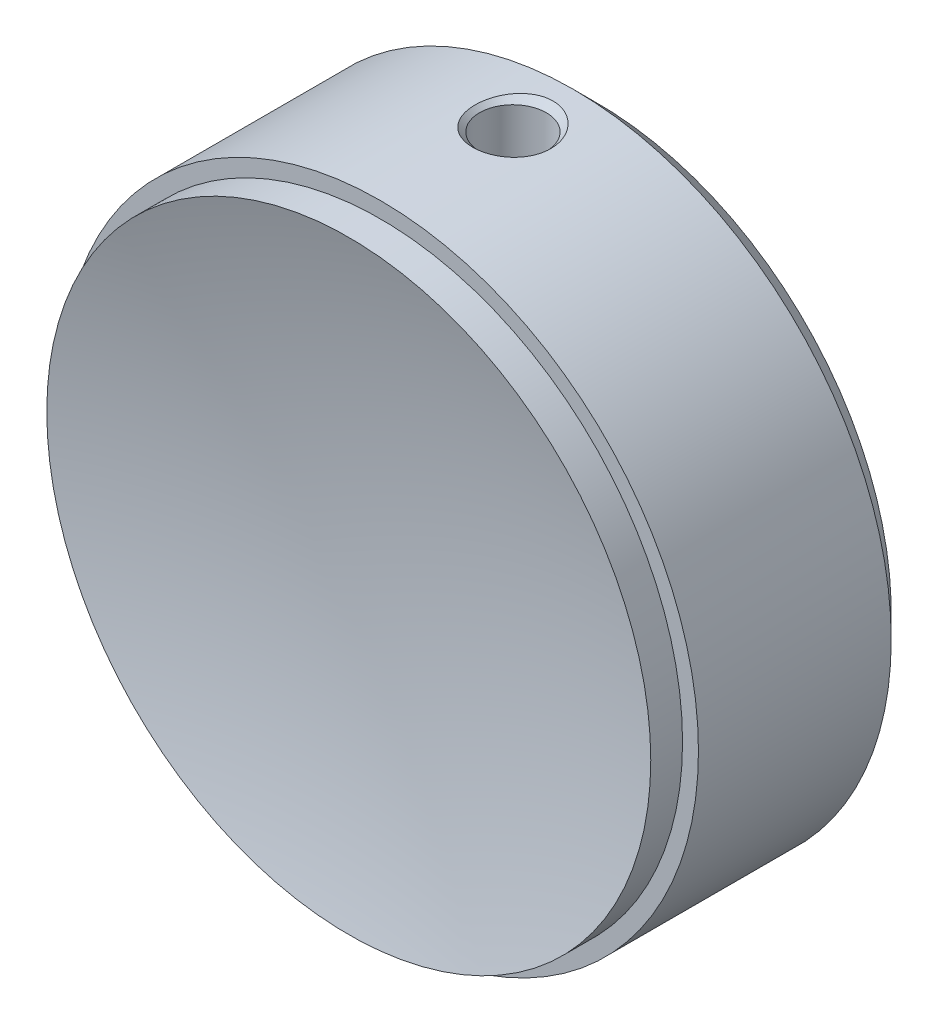
ISO-10303-21;
HEADER;
FILE_DESCRIPTION(('STEP AP214'),'2;1');
FILE_NAME('part.step','',(''),(''),'','','');
FILE_SCHEMA(('AUTOMOTIVE_DESIGN { 1 0 10303 214 1 1 1 1 }'));
ENDSEC;
DATA;
#1=APPLICATION_CONTEXT('core data for automotive mechanical design processes');
#2=APPLICATION_PROTOCOL_DEFINITION('international standard','automotive_design',2000,#1);
#3=PRODUCT_CONTEXT('',#1,'mechanical');
#4=PRODUCT('Part','Part','',(#3));
#5=PRODUCT_RELATED_PRODUCT_CATEGORY('part','',(#4));
#6=PRODUCT_DEFINITION_FORMATION('','',#4);
#7=PRODUCT_DEFINITION_CONTEXT('part definition',#1,'design');
#8=PRODUCT_DEFINITION('design','',#6,#7);
#9=PRODUCT_DEFINITION_SHAPE('','',#8);
#10=(LENGTH_UNIT() NAMED_UNIT(*) SI_UNIT(.MILLI.,.METRE.));
#11=(NAMED_UNIT(*) PLANE_ANGLE_UNIT() SI_UNIT($,.RADIAN.));
#12=(NAMED_UNIT(*) SI_UNIT($,.STERADIAN.) SOLID_ANGLE_UNIT());
#13=UNCERTAINTY_MEASURE_WITH_UNIT(LENGTH_MEASURE(1.E-05),#10,'distance_accuracy_value','');
#14=(GEOMETRIC_REPRESENTATION_CONTEXT(3) GLOBAL_UNCERTAINTY_ASSIGNED_CONTEXT((#13)) GLOBAL_UNIT_ASSIGNED_CONTEXT((#10,
#11,#12)) REPRESENTATION_CONTEXT('',''));
#15=CARTESIAN_POINT('',(0.,0.,0.));
#16=DIRECTION('',(0.,0.,1.));
#17=DIRECTION('',(1.,0.,0.));
#18=AXIS2_PLACEMENT_3D('',#15,#16,#17);
#19=CARTESIAN_POINT('',(0.,0.,83.));
#20=DIRECTION('',(0.,0.,-1.));
#21=DIRECTION('',(-1.,0.,0.));
#22=AXIS2_PLACEMENT_3D('',#19,#20,#21);
#23=SPHERICAL_SURFACE('',#22,70.);
#24=CARTESIAN_POINT('',(0.,0.,15.6278989491941));
#25=DIRECTION('',(0.,0.,-1.));
#26=DIRECTION('',(-1.,0.,0.));
#27=AXIS2_PLACEMENT_3D('',#24,#25,#26);
#28=CIRCLE('',#27,19.);
#29=CARTESIAN_POINT('',(-19.,0.,15.6278989491941));
#30=VERTEX_POINT('',#29);
#31=EDGE_CURVE('E97',#30,#30,#28,.T.);
#32=ORIENTED_EDGE('',*,*,#31,.F.);
#33=EDGE_LOOP('',(#32));
#34=FACE_BOUND('',#33,.T.);
#35=ADVANCED_FACE('F40',(#34),#23,.F.);
#36=CARTESIAN_POINT('',(0.,0.,0.));
#37=DIRECTION('',(0.,0.,-1.));
#38=DIRECTION('',(-1.,0.,0.));
#39=AXIS2_PLACEMENT_3D('',#36,#37,#38);
#40=SPHERICAL_SURFACE('',#39,6.5);
#41=CARTESIAN_POINT('',(0.,0.,0.));
#42=DIRECTION('',(0.,0.,-1.));
#43=DIRECTION('',(-1.,0.,0.));
#44=AXIS2_PLACEMENT_3D('',#41,#42,#43);
#45=CIRCLE('',#44,6.5);
#46=CARTESIAN_POINT('',(-6.5,0.,0.));
#47=VERTEX_POINT('',#46);
#48=EDGE_CURVE('E51',#47,#47,#45,.T.);
#49=ORIENTED_EDGE('',*,*,#48,.T.);
#50=EDGE_LOOP('',(#49));
#51=FACE_BOUND('',#50,.T.);
#52=ADVANCED_FACE('F114',(#51),#40,.F.);
#53=CARTESIAN_POINT('',(0.,0.,0.));
#54=DIRECTION('',(0.,0.,-1.));
#55=DIRECTION('',(-1.,0.,0.));
#56=AXIS2_PLACEMENT_3D('',#53,#54,#55);
#57=PLANE('',#56);
#58=CARTESIAN_POINT('',(0.,-10.795,0.));
#59=DIRECTION('',(0.,0.,-1.));
#60=DIRECTION('',(-1.,0.,0.));
#61=AXIS2_PLACEMENT_3D('',#58,#59,#60);
#62=CIRCLE('',#61,1.25);
#63=CARTESIAN_POINT('',(-1.25,-10.795,0.));
#64=VERTEX_POINT('',#63);
#65=EDGE_CURVE('E74',#64,#64,#62,.T.);
#66=ORIENTED_EDGE('',*,*,#65,.F.);
#67=EDGE_LOOP('',(#66));
#68=FACE_BOUND('',#67,.T.);
#69=CARTESIAN_POINT('',(9.34874423385299,5.39750000000004,0.));
#70=DIRECTION('',(0.,0.,-1.));
#71=DIRECTION('',(-1.,0.,0.));
#72=AXIS2_PLACEMENT_3D('',#69,#70,#71);
#73=CIRCLE('',#72,1.25);
#74=CARTESIAN_POINT('',(8.09874423385299,5.39750000000004,0.));
#75=VERTEX_POINT('',#74);
#76=EDGE_CURVE('E85',#75,#75,#73,.T.);
#77=ORIENTED_EDGE('',*,*,#76,.F.);
#78=EDGE_LOOP('',(#77));
#79=FACE_BOUND('',#78,.T.);
#80=CARTESIAN_POINT('',(-9.34874423385299,5.39750000000005,0.));
#81=DIRECTION('',(0.,0.,-1.));
#82=DIRECTION('',(-1.,0.,0.));
#83=AXIS2_PLACEMENT_3D('',#80,#81,#82);
#84=CIRCLE('',#83,1.25);
#85=CARTESIAN_POINT('',(-10.598744233853,5.39750000000005,0.));
#86=VERTEX_POINT('',#85);
#87=EDGE_CURVE('E91',#86,#86,#84,.T.);
#88=ORIENTED_EDGE('',*,*,#87,.F.);
#89=EDGE_LOOP('',(#88));
#90=FACE_BOUND('',#89,.T.);
#91=CARTESIAN_POINT('',(0.,0.,0.));
#92=DIRECTION('',(0.,0.,-1.));
#93=DIRECTION('',(-1.,0.,0.));
#94=AXIS2_PLACEMENT_3D('',#91,#92,#93);
#95=CIRCLE('',#94,18.5);
#96=CARTESIAN_POINT('',(-18.5,0.,0.));
#97=VERTEX_POINT('',#96);
#98=EDGE_CURVE('E109',#97,#97,#95,.T.);
#99=ORIENTED_EDGE('',*,*,#98,.T.);
#100=EDGE_LOOP('',(#99));
#101=FACE_BOUND('',#100,.T.);
#102=ORIENTED_EDGE('',*,*,#48,.F.);
#103=EDGE_LOOP('',(#102));
#104=FACE_BOUND('',#103,.T.);
#105=ADVANCED_FACE('F116',(#68,#79,#90,#101,#104),#57,.T.);
#106=CARTESIAN_POINT('',(0.,0.,0.));
#107=DIRECTION('',(0.,0.,1.));
#108=DIRECTION('',(1.,0.,0.));
#109=AXIS2_PLACEMENT_3D('',#106,#107,#108);
#110=CONICAL_SURFACE('',#109,18.5,0.785398163397446);
#111=CARTESIAN_POINT('',(0.,0.,1.5));
#112=DIRECTION('',(0.,0.,-1.));
#113=DIRECTION('',(-1.,0.,0.));
#114=AXIS2_PLACEMENT_3D('',#111,#112,#113);
#115=CIRCLE('',#114,20.);
#116=CARTESIAN_POINT('',(-20.,0.,1.5));
#117=VERTEX_POINT('',#116);
#118=EDGE_CURVE('E106',#117,#117,#115,.T.);
#119=ORIENTED_EDGE('',*,*,#118,.T.);
#120=EDGE_LOOP('',(#119));
#121=FACE_BOUND('',#120,.T.);
#122=ORIENTED_EDGE('',*,*,#98,.F.);
#123=EDGE_LOOP('',(#122));
#124=FACE_BOUND('',#123,.T.);
#125=ADVANCED_FACE('F118',(#121,#124),#110,.T.);
#126=CARTESIAN_POINT('',(0.,0.,-56.5285018674085));
#127=DIRECTION('',(0.,0.,-1.));
#128=DIRECTION('',(-1.,0.,0.));
#129=AXIS2_PLACEMENT_3D('',#126,#127,#128);
#130=CYLINDRICAL_SURFACE('',#129,20.);
#131=CARTESIAN_POINT('',(-1.72848355653172,19.9251686247571,3.5634312964973));
#132=CARTESIAN_POINT('',(-1.80916236032389,19.9181700964416,3.65361226683535));
#133=CARTESIAN_POINT('',(-1.88324256669418,19.9112506389055,3.74973931621038));
#134=CARTESIAN_POINT('',(-2.01699362309006,19.8981472175025,3.95165666970327));
#135=CARTESIAN_POINT('',(-2.07665133048352,19.8919639270585,4.05745566740705));
#136=CARTESIAN_POINT('',(-2.18970712823216,19.8798637568536,4.29562433479584));
#137=CARTESIAN_POINT('',(-2.24018320600533,19.874182823034,4.42940394642513));
#138=CARTESIAN_POINT('',(-2.31889440883089,19.8651529957625,4.70343931318513));
#139=CARTESIAN_POINT('',(-2.34712124289471,19.8618049717031,4.84369746189609));
#140=CARTESIAN_POINT('',(-2.38133836583172,19.8577326749337,5.13165817747994));
#141=CARTESIAN_POINT('',(-2.38656323733908,19.8570987349893,5.2794536032342));
#142=CARTESIAN_POINT('',(-2.37257317390649,19.8587749257272,5.57386905607279));
#143=CARTESIAN_POINT('',(-2.3533568867169,19.8610852193042,5.72048901767088));
#144=CARTESIAN_POINT('',(-2.29055916699759,19.8684257728992,6.00989636901333));
#145=CARTESIAN_POINT('',(-2.24673667641471,19.8734829266524,6.15263096042994));
#146=CARTESIAN_POINT('',(-2.13547365648976,19.8857453431787,6.42850738646069));
#147=CARTESIAN_POINT('',(-2.06803296395509,19.8929506207944,6.56164915478448));
#148=CARTESIAN_POINT('',(-1.91230028111797,19.9085185675656,6.81210392065155));
#149=CARTESIAN_POINT('',(-1.82436057776914,19.9168607893611,6.92963679817073));
#150=CARTESIAN_POINT('',(-1.6291381980811,19.9337771758378,7.14737322152417));
#151=CARTESIAN_POINT('',(-1.52186014996227,19.9423512846054,7.24758090255703));
#152=CARTESIAN_POINT('',(-1.29595189068302,19.9582748221931,7.42288290364966));
#153=CARTESIAN_POINT('',(-1.17803741265928,19.9656617288831,7.49889487727179));
#154=CARTESIAN_POINT('',(-0.930428173712866,19.9787292781997,7.62861154676929));
#155=CARTESIAN_POINT('',(-0.800738582066347,19.9844106648777,7.68232597411551));
#156=CARTESIAN_POINT('',(-0.541697282487983,19.9930571205335,7.76260622609559));
#157=CARTESIAN_POINT('',(-0.412796351025292,19.996165270711,7.79061324406122));
#158=CARTESIAN_POINT('',(-0.152058631601006,19.9998462662447,7.82368344509393));
#159=CARTESIAN_POINT('',(-0.020222710886534,20.0004198507921,7.82875331765505));
#160=CARTESIAN_POINT('',(0.236840138585867,19.998993950891,7.81601479583049));
#161=CARTESIAN_POINT('',(0.362115282338534,19.9970996761987,7.799141918083));
#162=CARTESIAN_POINT('',(0.608047095155684,19.9911334050874,7.74480160331066));
#163=CARTESIAN_POINT('',(0.728703827016444,19.9870614382898,7.70733444641151));
#164=CARTESIAN_POINT('',(0.962723619494116,19.977160981973,7.61299393602492));
#165=CARTESIAN_POINT('',(1.07605017918246,19.9713244174775,7.55603120717291));
#166=CARTESIAN_POINT('',(1.29204570932402,19.9585155756311,7.42471396030346));
#167=CARTESIAN_POINT('',(1.39471275089394,19.9515430933156,7.35035630249449));
#168=CARTESIAN_POINT('',(1.59148713083687,19.9368340417464,7.1828625943749));
#169=CARTESIAN_POINT('',(1.68500109977288,19.9290772056954,7.08903189919098));
#170=CARTESIAN_POINT('',(1.85598111906827,19.9138825857265,6.88772696869591));
#171=CARTESIAN_POINT('',(1.93344297937923,19.9064448855128,6.78024918289065));
#172=CARTESIAN_POINT('',(2.0748107456073,19.8922224291927,6.54803487236839));
#173=CARTESIAN_POINT('',(2.13767509482587,19.8855002100057,6.42266002309261));
#174=CARTESIAN_POINT('',(2.24255055857105,19.8739467584607,6.16339218476214));
#175=CARTESIAN_POINT('',(2.28455698333462,19.8691159514255,6.02949728766021));
#176=CARTESIAN_POINT('',(2.34828070452537,19.8616884482688,5.75073237393973));
#177=CARTESIAN_POINT('',(2.36903355048059,19.8591983416609,5.60563837071823));
#178=CARTESIAN_POINT('',(2.38653839635382,19.8571022850963,5.313981911778));
#179=CARTESIAN_POINT('',(2.38328712366273,19.8574967284054,5.16741925855066));
#180=CARTESIAN_POINT('',(2.35256238169467,19.8611604692563,4.8741652090461));
#181=CARTESIAN_POINT('',(2.3246473302838,19.8644821738956,4.72752040993484));
#182=CARTESIAN_POINT('',(2.24456159779973,19.8736900259715,4.44107371218227));
#183=CARTESIAN_POINT('',(2.19238994560447,19.8795762760802,4.30127208775773));
#184=CARTESIAN_POINT('',(2.06537472265378,19.893171183711,4.03370379776386));
#185=CARTESIAN_POINT('',(1.99069951958717,19.9008662172658,3.90585669186003));
#186=CARTESIAN_POINT('',(1.82022142632013,19.9171809669381,3.66515586443558));
#187=CARTESIAN_POINT('',(1.72442162091451,19.9258005479509,3.55229995762382));
#188=CARTESIAN_POINT('',(1.51780326270613,19.9425828331201,3.34925448894258));
#189=CARTESIAN_POINT('',(1.40763452320779,19.9507509223304,3.25840524726568));
#190=CARTESIAN_POINT('',(1.17276380187483,19.9659316118607,3.09783699641653));
#191=CARTESIAN_POINT('',(1.04806767319664,19.9729446748164,3.02810951766875));
#192=CARTESIAN_POINT('',(0.795466375409217,19.9845507475958,2.91609195415773));
#193=CARTESIAN_POINT('',(0.668169664229902,19.989260787671,2.87244194265796));
#194=CARTESIAN_POINT('',(0.407810987499063,19.9962649143991,2.80833202613789));
#195=CARTESIAN_POINT('',(0.274751311138175,19.998559951351,2.78786299920551));
#196=CARTESIAN_POINT('',(0.0140399205119802,20.0003981042917,2.77144022304166));
#197=CARTESIAN_POINT('',(-0.113535895268272,20.0000773108847,2.77427418479963));
#198=CARTESIAN_POINT('',(-0.366347497170038,19.9970439846532,2.80147011895599));
#199=CARTESIAN_POINT('',(-0.491583213914496,19.9943313810331,2.82583272858468));
#200=CARTESIAN_POINT('',(-0.73477019804403,19.9868649322058,2.89472104864989));
#201=CARTESIAN_POINT('',(-0.852787041836256,19.9821341487296,2.93901925996688));
#202=CARTESIAN_POINT('',(-1.07997167427885,19.9711441116699,3.0460877718982));
#203=CARTESIAN_POINT('',(-1.18914363211055,19.9648855838625,3.10884930415184));
#204=CARTESIAN_POINT('',(-1.37267511717082,19.9530003882042,3.23465321276595));
#205=CARTESIAN_POINT('',(-1.44932236612874,19.9475511574337,3.29441898925904));
#206=CARTESIAN_POINT('',(-1.59488657023043,19.9364405178695,3.42266125817308));
#207=CARTESIAN_POINT('',(-1.66380546043022,19.9307791626641,3.49113556091504));
#208=CARTESIAN_POINT('',(-1.72848355653172,19.9251686247571,3.5634312964973));
#209=B_SPLINE_CURVE_WITH_KNOTS('',3,(#131,#132,#133,#134,#135,#136,#137,#138,#139,#140,#141,
#142,#143,#144,#145,#146,#147,#148,#149,#150,#151,#152,#153,#154,#155,#156,#157,#158,#159,#160,
#161,#162,#163,#164,#165,#166,#167,#168,#169,#170,#171,#172,#173,#174,#175,#176,#177,#178,#179,
#180,#181,#182,#183,#184,#185,#186,#187,#188,#189,#190,#191,#192,#193,#194,#195,#196,#197,#198,
#199,#200,#201,#202,#203,#204,#205,#206,#207,#208),.UNSPECIFIED.,.T.,.F.,(4,2,2,2,2,2,2,2,2,2,2,
2,2,2,2,2,2,2,2,2,2,2,2,2,2,2,2,2,2,2,2,2,2,2,2,2,2,2,4),(0.,0.363349894192856,
0.727029656629002,1.15434751215555,1.58182452881065,2.02342376013595,2.46504742476987,
2.91107495518262,3.35710556753306,3.79597252973863,4.23473459760971,4.65401114434888,
5.07310451047529,5.46693783727458,5.86065629731343,6.23812659894594,6.61559176631229,
6.99481109071646,7.37409891724421,7.77046070517102,8.16692582462617,8.58629315032385,
9.00575472527509,9.4435046838005,9.88131432420684,10.3271250690618,10.7729536636533,
11.2155261407777,11.6580340324388,12.0849157819262,12.5116261296277,12.9135184058765,
13.3152524791279,13.69622478133,14.0772083603773,14.453950380671,14.8305137715748,
15.1218750358259,15.4131631842672),.UNSPECIFIED.);
#210=CARTESIAN_POINT('',(-1.72848355653172,19.9251686247571,3.5634312964973));
#211=VERTEX_POINT('',#210);
#212=EDGE_CURVE('E11',#211,#211,#209,.T.);
#213=ORIENTED_EDGE('',*,*,#212,.F.);
#214=EDGE_LOOP('',(#213));
#215=FACE_BOUND('',#214,.T.);
#216=CARTESIAN_POINT('',(0.,0.,13.6278989491941));
#217=DIRECTION('',(0.,0.,-1.));
#218=DIRECTION('',(-1.,0.,0.));
#219=AXIS2_PLACEMENT_3D('',#216,#217,#218);
#220=CIRCLE('',#219,20.);
#221=CARTESIAN_POINT('',(-20.,0.,13.6278989491941));
#222=VERTEX_POINT('',#221);
#223=EDGE_CURVE('E103',#222,#222,#220,.T.);
#224=ORIENTED_EDGE('',*,*,#223,.T.);
#225=EDGE_LOOP('',(#224));
#226=FACE_BOUND('',#225,.T.);
#227=ORIENTED_EDGE('',*,*,#118,.F.);
#228=EDGE_LOOP('',(#227));
#229=FACE_BOUND('',#228,.T.);
#230=ADVANCED_FACE('F125',(#215,#226,#229),#130,.T.);
#231=CARTESIAN_POINT('',(0.,0.,13.6278989491941));
#232=DIRECTION('',(0.,0.,1.));
#233=DIRECTION('',(1.,0.,0.));
#234=AXIS2_PLACEMENT_3D('',#231,#232,#233);
#235=PLANE('',#234);
#236=CARTESIAN_POINT('',(0.,0.,13.6278989491941));
#237=DIRECTION('',(0.,0.,-1.));
#238=DIRECTION('',(-1.,0.,0.));
#239=AXIS2_PLACEMENT_3D('',#236,#237,#238);
#240=CIRCLE('',#239,19.);
#241=CARTESIAN_POINT('',(-19.,0.,13.6278989491941));
#242=VERTEX_POINT('',#241);
#243=EDGE_CURVE('E100',#242,#242,#240,.T.);
#244=ORIENTED_EDGE('',*,*,#243,.T.);
#245=EDGE_LOOP('',(#244));
#246=FACE_BOUND('',#245,.T.);
#247=ORIENTED_EDGE('',*,*,#223,.F.);
#248=EDGE_LOOP('',(#247));
#249=FACE_BOUND('',#248,.T.);
#250=ADVANCED_FACE('F140',(#246,#249),#235,.T.);
#251=CARTESIAN_POINT('',(0.,0.,-56.5285018674085));
#252=DIRECTION('',(0.,0.,-1.));
#253=DIRECTION('',(-1.,0.,0.));
#254=AXIS2_PLACEMENT_3D('',#251,#252,#253);
#255=CYLINDRICAL_SURFACE('',#254,19.);
#256=ORIENTED_EDGE('',*,*,#31,.T.);
#257=EDGE_LOOP('',(#256));
#258=FACE_BOUND('',#257,.T.);
#259=ORIENTED_EDGE('',*,*,#243,.F.);
#260=EDGE_LOOP('',(#259));
#261=FACE_BOUND('',#260,.T.);
#262=ADVANCED_FACE('F136',(#258,#261),#255,.T.);
#263=CARTESIAN_POINT('',(-9.34874423385299,5.39750000000005,7.5));
#264=DIRECTION('',(0.,0.,-1.));
#265=DIRECTION('',(-1.,0.,0.));
#266=AXIS2_PLACEMENT_3D('',#263,#264,#265);
#267=CONICAL_SURFACE('',#266,1.25,1.02974425867665);
#268=CARTESIAN_POINT('',(-9.34874423385299,5.39750000000005,8.25107577378445));
#269=VERTEX_POINT('',#268);
#270=VERTEX_LOOP('',#269);
#271=FACE_BOUND('',#270,.T.);
#272=CARTESIAN_POINT('',(-9.34874423385299,5.39750000000005,7.5));
#273=DIRECTION('',(0.,0.,-1.));
#274=DIRECTION('',(-1.,0.,0.));
#275=AXIS2_PLACEMENT_3D('',#272,#273,#274);
#276=CIRCLE('',#275,1.25);
#277=CARTESIAN_POINT('',(-10.598744233853,5.39750000000005,7.5));
#278=VERTEX_POINT('',#277);
#279=EDGE_CURVE('E94',#278,#278,#276,.T.);
#280=ORIENTED_EDGE('',*,*,#279,.T.);
#281=EDGE_LOOP('',(#280));
#282=FACE_BOUND('',#281,.T.);
#283=ADVANCED_FACE('F139',(#271,#282),#267,.F.);
#284=CARTESIAN_POINT('',(-9.34874423385299,5.39750000000005,0.));
#285=DIRECTION('',(0.,0.,-1.));
#286=DIRECTION('',(-1.,0.,0.));
#287=AXIS2_PLACEMENT_3D('',#284,#285,#286);
#288=CYLINDRICAL_SURFACE('',#287,1.25);
#289=ORIENTED_EDGE('',*,*,#279,.F.);
#290=EDGE_LOOP('',(#289));
#291=FACE_BOUND('',#290,.T.);
#292=ORIENTED_EDGE('',*,*,#87,.T.);
#293=EDGE_LOOP('',(#292));
#294=FACE_BOUND('',#293,.T.);
#295=ADVANCED_FACE('F163',(#291,#294),#288,.F.);
#296=CARTESIAN_POINT('',(9.34874423385299,5.39750000000004,7.5));
#297=DIRECTION('',(0.,0.,-1.));
#298=DIRECTION('',(-1.,0.,0.));
#299=AXIS2_PLACEMENT_3D('',#296,#297,#298);
#300=CONICAL_SURFACE('',#299,1.25,1.02974425867665);
#301=CARTESIAN_POINT('',(9.34874423385299,5.39750000000004,8.25107577378445));
#302=VERTEX_POINT('',#301);
#303=VERTEX_LOOP('',#302);
#304=FACE_BOUND('',#303,.T.);
#305=CARTESIAN_POINT('',(9.34874423385299,5.39750000000004,7.5));
#306=DIRECTION('',(0.,0.,-1.));
#307=DIRECTION('',(-1.,0.,0.));
#308=AXIS2_PLACEMENT_3D('',#305,#306,#307);
#309=CIRCLE('',#308,1.25);
#310=CARTESIAN_POINT('',(8.09874423385299,5.39750000000004,7.5));
#311=VERTEX_POINT('',#310);
#312=EDGE_CURVE('E88',#311,#311,#309,.T.);
#313=ORIENTED_EDGE('',*,*,#312,.T.);
#314=EDGE_LOOP('',(#313));
#315=FACE_BOUND('',#314,.T.);
#316=ADVANCED_FACE('F166',(#304,#315),#300,.F.);
#317=CARTESIAN_POINT('',(9.34874423385299,5.39750000000004,0.));
#318=DIRECTION('',(0.,0.,-1.));
#319=DIRECTION('',(-1.,0.,0.));
#320=AXIS2_PLACEMENT_3D('',#317,#318,#319);
#321=CYLINDRICAL_SURFACE('',#320,1.25);
#322=ORIENTED_EDGE('',*,*,#312,.F.);
#323=EDGE_LOOP('',(#322));
#324=FACE_BOUND('',#323,.T.);
#325=ORIENTED_EDGE('',*,*,#76,.T.);
#326=EDGE_LOOP('',(#325));
#327=FACE_BOUND('',#326,.T.);
#328=ADVANCED_FACE('F170',(#324,#327),#321,.F.);
#329=CARTESIAN_POINT('',(0.,-10.795,7.5));
#330=DIRECTION('',(0.,0.,-1.));
#331=DIRECTION('',(-1.,0.,0.));
#332=AXIS2_PLACEMENT_3D('',#329,#330,#331);
#333=CONICAL_SURFACE('',#332,1.25,1.02974425867665);
#334=CARTESIAN_POINT('',(0.,-10.795,8.25107577378445));
#335=VERTEX_POINT('',#334);
#336=VERTEX_LOOP('',#335);
#337=FACE_BOUND('',#336,.T.);
#338=CARTESIAN_POINT('',(0.,-10.795,7.5));
#339=DIRECTION('',(0.,0.,-1.));
#340=DIRECTION('',(-1.,0.,0.));
#341=AXIS2_PLACEMENT_3D('',#338,#339,#340);
#342=CIRCLE('',#341,1.25);
#343=CARTESIAN_POINT('',(-1.25,-10.795,7.5));
#344=VERTEX_POINT('',#343);
#345=EDGE_CURVE('E78',#344,#344,#342,.T.);
#346=ORIENTED_EDGE('',*,*,#345,.T.);
#347=EDGE_LOOP('',(#346));
#348=FACE_BOUND('',#347,.T.);
#349=ADVANCED_FACE('F173',(#337,#348),#333,.F.);
#350=CARTESIAN_POINT('',(0.,-10.795,0.));
#351=DIRECTION('',(0.,0.,-1.));
#352=DIRECTION('',(-1.,0.,0.));
#353=AXIS2_PLACEMENT_3D('',#350,#351,#352);
#354=CYLINDRICAL_SURFACE('',#353,1.25);
#355=ORIENTED_EDGE('',*,*,#345,.F.);
#356=EDGE_LOOP('',(#355));
#357=FACE_BOUND('',#356,.T.);
#358=ORIENTED_EDGE('',*,*,#65,.T.);
#359=EDGE_LOOP('',(#358));
#360=FACE_BOUND('',#359,.T.);
#361=ADVANCED_FACE('F68',(#357,#360),#354,.F.);
#362=CARTESIAN_POINT('',(0.,7.60000000000004,5.3));
#363=DIRECTION('',(0.,1.,0.));
#364=DIRECTION('',(0.,0.,1.));
#365=AXIS2_PLACEMENT_3D('',#362,#363,#364);
#366=CONICAL_SURFACE('',#365,2.1,1.02974425867665);
#367=CARTESIAN_POINT('',(0.,6.33819270004216,5.3));
#368=VERTEX_POINT('',#367);
#369=VERTEX_LOOP('',#368);
#370=FACE_BOUND('',#369,.T.);
#371=CARTESIAN_POINT('',(0.,7.60000000000004,5.3));
#372=DIRECTION('',(0.,1.,0.));
#373=DIRECTION('',(0.,0.,1.));
#374=AXIS2_PLACEMENT_3D('',#371,#372,#373);
#375=CIRCLE('',#374,2.1);
#376=CARTESIAN_POINT('',(0.,7.60000000000004,7.4));
#377=VERTEX_POINT('',#376);
#378=EDGE_CURVE('E72',#377,#377,#375,.T.);
#379=ORIENTED_EDGE('',*,*,#378,.T.);
#380=EDGE_LOOP('',(#379));
#381=FACE_BOUND('',#380,.T.);
#382=ADVANCED_FACE('F64',(#370,#381),#366,.F.);
#383=CARTESIAN_POINT('',(0.,20.,5.3));
#384=DIRECTION('',(0.,1.,0.));
#385=DIRECTION('',(0.,0.,1.));
#386=AXIS2_PLACEMENT_3D('',#383,#384,#385);
#387=CYLINDRICAL_SURFACE('',#386,2.1);
#388=ORIENTED_EDGE('',*,*,#378,.F.);
#389=EDGE_LOOP('',(#388));
#390=FACE_BOUND('',#389,.T.);
#391=CARTESIAN_POINT('',(0.,19.575,5.3));
#392=DIRECTION('',(0.,1.,0.));
#393=DIRECTION('',(0.,0.,1.));
#394=AXIS2_PLACEMENT_3D('',#391,#392,#393);
#395=CIRCLE('',#394,2.1);
#396=CARTESIAN_POINT('',(0.,19.575,7.4));
#397=VERTEX_POINT('',#396);
#398=EDGE_CURVE('E75',#397,#397,#395,.T.);
#399=ORIENTED_EDGE('',*,*,#398,.T.);
#400=EDGE_LOOP('',(#399));
#401=FACE_BOUND('',#400,.T.);
#402=ADVANCED_FACE('F67',(#390,#401),#387,.F.);
#403=CARTESIAN_POINT('',(0.,20.,5.3));
#404=DIRECTION('',(0.,1.,0.));
#405=DIRECTION('',(0.,0.,1.));
#406=AXIS2_PLACEMENT_3D('',#403,#404,#405);
#407=CONICAL_SURFACE('',#406,2.525,0.785398163397448);
#408=ORIENTED_EDGE('',*,*,#212,.T.);
#409=EDGE_LOOP('',(#408));
#410=FACE_BOUND('',#409,.T.);
#411=ORIENTED_EDGE('',*,*,#398,.F.);
#412=EDGE_LOOP('',(#411));
#413=FACE_BOUND('',#412,.T.);
#414=ADVANCED_FACE('F182',(#410,#413),#407,.F.);
#415=CLOSED_SHELL('',(#35,#52,#105,#125,#230,#250,#262,#283,#295,#316,#328,#349,#361,#382,#402,#414));
#416=MANIFOLD_SOLID_BREP('B2',#415);
#417=ADVANCED_BREP_SHAPE_REPRESENTATION('',(#18,#416),#14);
#418=SHAPE_DEFINITION_REPRESENTATION(#9,#417);
ENDSEC;
END-ISO-10303-21;
